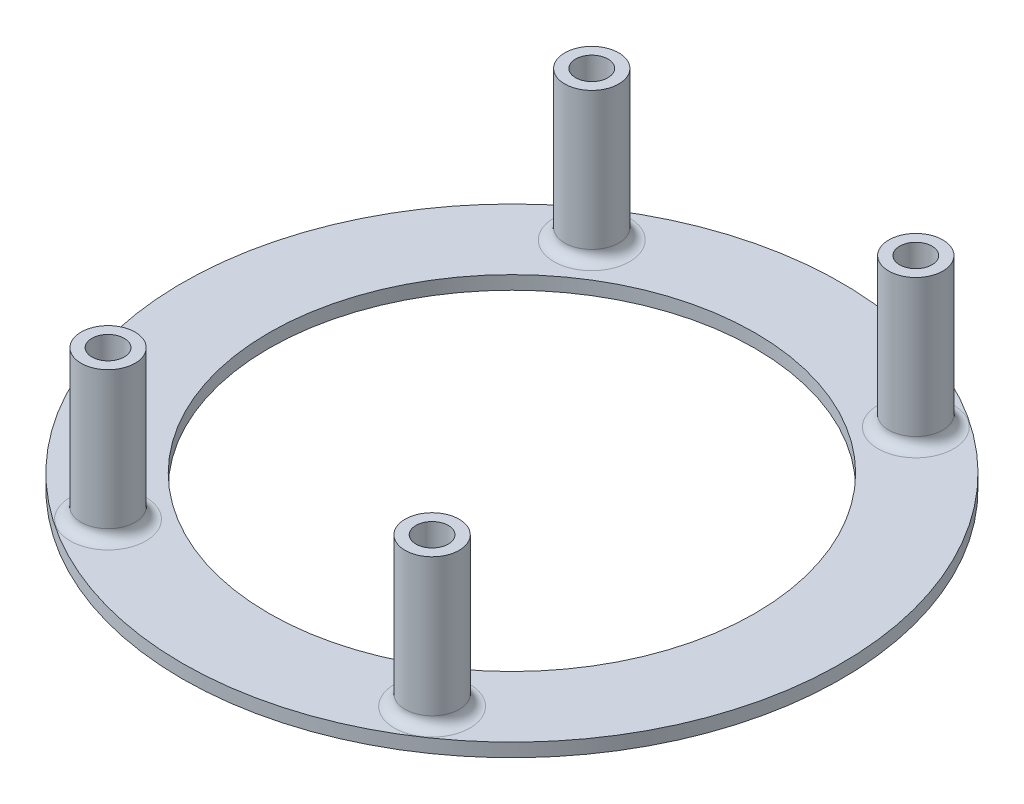
ISO-10303-21;
HEADER;
FILE_DESCRIPTION(('STEP AP214'),'2;1');
FILE_NAME('part.step','',(''),(''),'','','');
FILE_SCHEMA(('AUTOMOTIVE_DESIGN { 1 0 10303 214 1 1 1 1 }'));
ENDSEC;
DATA;
#1=APPLICATION_CONTEXT('core data for automotive mechanical design processes');
#2=APPLICATION_PROTOCOL_DEFINITION('international standard','automotive_design',2000,#1);
#3=PRODUCT_CONTEXT('',#1,'mechanical');
#4=PRODUCT('Part','Part','',(#3));
#5=PRODUCT_RELATED_PRODUCT_CATEGORY('part','',(#4));
#6=PRODUCT_DEFINITION_FORMATION('','',#4);
#7=PRODUCT_DEFINITION_CONTEXT('part definition',#1,'design');
#8=PRODUCT_DEFINITION('design','',#6,#7);
#9=PRODUCT_DEFINITION_SHAPE('','',#8);
#10=(LENGTH_UNIT() NAMED_UNIT(*) SI_UNIT(.MILLI.,.METRE.));
#11=(NAMED_UNIT(*) PLANE_ANGLE_UNIT() SI_UNIT($,.RADIAN.));
#12=(NAMED_UNIT(*) SI_UNIT($,.STERADIAN.) SOLID_ANGLE_UNIT());
#13=UNCERTAINTY_MEASURE_WITH_UNIT(LENGTH_MEASURE(1.E-05),#10,'distance_accuracy_value','');
#14=(GEOMETRIC_REPRESENTATION_CONTEXT(3) GLOBAL_UNCERTAINTY_ASSIGNED_CONTEXT((#13)) GLOBAL_UNIT_ASSIGNED_CONTEXT((#10,
#11,#12)) REPRESENTATION_CONTEXT('',''));
#15=CARTESIAN_POINT('',(0.,0.,0.));
#16=DIRECTION('',(0.,0.,1.));
#17=DIRECTION('',(1.,0.,0.));
#18=AXIS2_PLACEMENT_3D('',#15,#16,#17);
#19=CARTESIAN_POINT('',(-38.1,-5.40765999999999,-56.8700554685856));
#20=DIRECTION('',(0.,1.,0.));
#21=DIRECTION('',(0.,0.,1.));
#22=AXIS2_PLACEMENT_3D('',#19,#20,#21);
#23=PLANE('',#22);
#24=CARTESIAN_POINT('',(-38.1,-5.40765999999999,-56.8700554685856));
#25=DIRECTION('',(0.,1.,0.));
#26=DIRECTION('',(0.,0.,1.));
#27=AXIS2_PLACEMENT_3D('',#24,#25,#26);
#28=CIRCLE('',#27,6.35);
#29=CARTESIAN_POINT('',(-38.1,-5.40765999999999,-50.5200554685856));
#30=VERTEX_POINT('',#29);
#31=EDGE_CURVE('E73',#30,#30,#28,.T.);
#32=ORIENTED_EDGE('',*,*,#31,.T.);
#33=EDGE_LOOP('',(#32));
#34=FACE_BOUND('',#33,.T.);
#35=CARTESIAN_POINT('',(-38.1,-5.40765999999999,-56.8700554685856));
#36=DIRECTION('',(0.,1.,0.));
#37=DIRECTION('',(0.,0.,1.));
#38=AXIS2_PLACEMENT_3D('',#35,#36,#37);
#39=CIRCLE('',#38,3.81);
#40=CARTESIAN_POINT('',(-38.1,-5.40765999999999,-53.0600554685856));
#41=VERTEX_POINT('',#40);
#42=EDGE_CURVE('E76',#41,#41,#39,.T.);
#43=ORIENTED_EDGE('',*,*,#42,.F.);
#44=EDGE_LOOP('',(#43));
#45=FACE_BOUND('',#44,.T.);
#46=ADVANCED_FACE('F41',(#34,#45),#23,.T.);
#47=CARTESIAN_POINT('',(-38.1,-5.40765999999999,-56.8700554685856));
#48=DIRECTION('',(0.,-1.,0.));
#49=DIRECTION('',(0.,0.,-1.));
#50=AXIS2_PLACEMENT_3D('',#47,#48,#49);
#51=CYLINDRICAL_SURFACE('',#50,6.35);
#52=CARTESIAN_POINT('',(-38.1,-37.79266,-56.8700554685856));
#53=DIRECTION('',(0.,1.,0.));
#54=DIRECTION('',(0.,0.,1.));
#55=AXIS2_PLACEMENT_3D('',#52,#53,#54);
#56=CIRCLE('',#55,6.35);
#57=CARTESIAN_POINT('',(-38.1,-37.79266,-50.5200554685856));
#58=VERTEX_POINT('',#57);
#59=EDGE_CURVE('E48',#58,#58,#56,.T.);
#60=ORIENTED_EDGE('',*,*,#59,.T.);
#61=EDGE_LOOP('',(#60));
#62=FACE_BOUND('',#61,.T.);
#63=ORIENTED_EDGE('',*,*,#31,.F.);
#64=EDGE_LOOP('',(#63));
#65=FACE_BOUND('',#64,.T.);
#66=ADVANCED_FACE('F146',(#62,#65),#51,.T.);
#67=CARTESIAN_POINT('',(-38.1,-5.40765999999999,-56.8700554685856));
#68=DIRECTION('',(0.,-1.,0.));
#69=DIRECTION('',(0.,0.,-1.));
#70=AXIS2_PLACEMENT_3D('',#67,#68,#69);
#71=CYLINDRICAL_SURFACE('',#70,3.81);
#72=ORIENTED_EDGE('',*,*,#42,.T.);
#73=EDGE_LOOP('',(#72));
#74=FACE_BOUND('',#73,.T.);
#75=CARTESIAN_POINT('',(-38.1,-43.50766,-56.8700554685856));
#76=DIRECTION('',(0.,1.,0.));
#77=DIRECTION('',(0.,0.,1.));
#78=AXIS2_PLACEMENT_3D('',#75,#76,#77);
#79=CIRCLE('',#78,3.81);
#80=CARTESIAN_POINT('',(-38.1,-43.50766,-53.0600554685856));
#81=VERTEX_POINT('',#80);
#82=EDGE_CURVE('E113',#81,#81,#79,.T.);
#83=ORIENTED_EDGE('',*,*,#82,.F.);
#84=EDGE_LOOP('',(#83));
#85=FACE_BOUND('',#84,.T.);
#86=ADVANCED_FACE('F153',(#74,#85),#71,.F.);
#87=CARTESIAN_POINT('',(0.,-43.50766,0.));
#88=DIRECTION('',(0.,1.,0.));
#89=DIRECTION('',(0.,0.,1.));
#90=AXIS2_PLACEMENT_3D('',#87,#88,#89);
#91=CYLINDRICAL_SURFACE('',#90,77.4954);
#92=CARTESIAN_POINT('',(0.,-43.50766,0.));
#93=DIRECTION('',(0.,1.,0.));
#94=DIRECTION('',(0.,0.,1.));
#95=AXIS2_PLACEMENT_3D('',#92,#93,#94);
#96=CIRCLE('',#95,77.4954);
#97=CARTESIAN_POINT('',(0.,-43.50766,77.4954));
#98=VERTEX_POINT('',#97);
#99=EDGE_CURVE('E79',#98,#98,#96,.T.);
#100=ORIENTED_EDGE('',*,*,#99,.T.);
#101=EDGE_LOOP('',(#100));
#102=FACE_BOUND('',#101,.T.);
#103=CARTESIAN_POINT('',(0.,-40.33266,0.));
#104=DIRECTION('',(0.,1.,0.));
#105=DIRECTION('',(0.,0.,1.));
#106=AXIS2_PLACEMENT_3D('',#103,#104,#105);
#107=CIRCLE('',#106,77.4954);
#108=CARTESIAN_POINT('',(0.,-40.33266,77.4954));
#109=VERTEX_POINT('',#108);
#110=EDGE_CURVE('E80',#109,#109,#107,.T.);
#111=ORIENTED_EDGE('',*,*,#110,.F.);
#112=EDGE_LOOP('',(#111));
#113=FACE_BOUND('',#112,.T.);
#114=ADVANCED_FACE('F189',(#102,#113),#91,.T.);
#115=CARTESIAN_POINT('',(0.,-43.50766,0.));
#116=DIRECTION('',(0.,1.,0.));
#117=DIRECTION('',(0.,0.,1.));
#118=AXIS2_PLACEMENT_3D('',#115,#116,#117);
#119=PLANE('',#118);
#120=ORIENTED_EDGE('',*,*,#82,.T.);
#121=EDGE_LOOP('',(#120));
#122=FACE_BOUND('',#121,.T.);
#123=CARTESIAN_POINT('',(38.1,-43.50766,-56.8700554685856));
#124=DIRECTION('',(0.,1.,0.));
#125=DIRECTION('',(0.,0.,1.));
#126=AXIS2_PLACEMENT_3D('',#123,#124,#125);
#127=CIRCLE('',#126,3.81);
#128=CARTESIAN_POINT('',(38.1,-43.50766,-53.0600554685856));
#129=VERTEX_POINT('',#128);
#130=EDGE_CURVE('E116',#129,#129,#127,.T.);
#131=ORIENTED_EDGE('',*,*,#130,.T.);
#132=EDGE_LOOP('',(#131));
#133=FACE_BOUND('',#132,.T.);
#134=CARTESIAN_POINT('',(38.1,-43.50766,56.8700554685856));
#135=DIRECTION('',(0.,1.,0.));
#136=DIRECTION('',(0.,0.,1.));
#137=AXIS2_PLACEMENT_3D('',#134,#135,#136);
#138=CIRCLE('',#137,3.81);
#139=CARTESIAN_POINT('',(38.1,-43.50766,60.6800554685856));
#140=VERTEX_POINT('',#139);
#141=EDGE_CURVE('E112',#140,#140,#138,.T.);
#142=ORIENTED_EDGE('',*,*,#141,.T.);
#143=EDGE_LOOP('',(#142));
#144=FACE_BOUND('',#143,.T.);
#145=CARTESIAN_POINT('',(-38.1,-43.50766,56.8700554685856));
#146=DIRECTION('',(0.,1.,0.));
#147=DIRECTION('',(0.,0.,1.));
#148=AXIS2_PLACEMENT_3D('',#145,#146,#147);
#149=CIRCLE('',#148,3.81);
#150=CARTESIAN_POINT('',(-38.1,-43.50766,60.6800554685856));
#151=VERTEX_POINT('',#150);
#152=EDGE_CURVE('E109',#151,#151,#149,.T.);
#153=ORIENTED_EDGE('',*,*,#152,.T.);
#154=EDGE_LOOP('',(#153));
#155=FACE_BOUND('',#154,.T.);
#156=CARTESIAN_POINT('',(0.,-43.50766,0.));
#157=DIRECTION('',(0.,1.,0.));
#158=DIRECTION('',(0.,0.,1.));
#159=AXIS2_PLACEMENT_3D('',#156,#157,#158);
#160=CIRCLE('',#159,57.15);
#161=CARTESIAN_POINT('',(0.,-43.50766,57.15));
#162=VERTEX_POINT('',#161);
#163=EDGE_CURVE('E83',#162,#162,#160,.T.);
#164=ORIENTED_EDGE('',*,*,#163,.T.);
#165=EDGE_LOOP('',(#164));
#166=FACE_BOUND('',#165,.T.);
#167=ORIENTED_EDGE('',*,*,#99,.F.);
#168=EDGE_LOOP('',(#167));
#169=FACE_BOUND('',#168,.T.);
#170=ADVANCED_FACE('F122',(#122,#133,#144,#155,#166,#169),#119,.F.);
#171=CARTESIAN_POINT('',(0.,-40.33266,0.));
#172=DIRECTION('',(0.,1.,0.));
#173=DIRECTION('',(0.,0.,1.));
#174=AXIS2_PLACEMENT_3D('',#171,#172,#173);
#175=PLANE('',#174);
#176=CARTESIAN_POINT('',(38.1,-40.33266,56.8700554685856));
#177=DIRECTION('',(0.,1.,0.));
#178=DIRECTION('',(0.,0.,1.));
#179=AXIS2_PLACEMENT_3D('',#176,#177,#178);
#180=CIRCLE('',#179,8.89);
#181=CARTESIAN_POINT('',(38.1,-40.33266,65.7600554685856));
#182=VERTEX_POINT('',#181);
#183=EDGE_CURVE('E56',#182,#182,#180,.F.);
#184=ORIENTED_EDGE('',*,*,#183,.T.);
#185=EDGE_LOOP('',(#184));
#186=FACE_BOUND('',#185,.T.);
#187=CARTESIAN_POINT('',(-38.1,-40.33266,56.8700554685856));
#188=DIRECTION('',(0.,1.,0.));
#189=DIRECTION('',(0.,0.,1.));
#190=AXIS2_PLACEMENT_3D('',#187,#188,#189);
#191=CIRCLE('',#190,8.89);
#192=CARTESIAN_POINT('',(-38.1,-40.33266,65.7600554685856));
#193=VERTEX_POINT('',#192);
#194=EDGE_CURVE('E61',#193,#193,#191,.F.);
#195=ORIENTED_EDGE('',*,*,#194,.T.);
#196=EDGE_LOOP('',(#195));
#197=FACE_BOUND('',#196,.T.);
#198=CARTESIAN_POINT('',(-38.1,-40.33266,-56.8700554685856));
#199=DIRECTION('',(0.,1.,0.));
#200=DIRECTION('',(0.,0.,1.));
#201=AXIS2_PLACEMENT_3D('',#198,#199,#200);
#202=CIRCLE('',#201,8.89);
#203=CARTESIAN_POINT('',(-38.1,-40.33266,-47.9800554685856));
#204=VERTEX_POINT('',#203);
#205=EDGE_CURVE('E64',#204,#204,#202,.F.);
#206=ORIENTED_EDGE('',*,*,#205,.T.);
#207=EDGE_LOOP('',(#206));
#208=FACE_BOUND('',#207,.T.);
#209=CARTESIAN_POINT('',(38.1,-40.33266,-56.8700554685856));
#210=DIRECTION('',(0.,1.,0.));
#211=DIRECTION('',(0.,0.,1.));
#212=AXIS2_PLACEMENT_3D('',#209,#210,#211);
#213=CIRCLE('',#212,8.89);
#214=CARTESIAN_POINT('',(38.1,-40.33266,-47.9800554685856));
#215=VERTEX_POINT('',#214);
#216=EDGE_CURVE('E67',#215,#215,#213,.F.);
#217=ORIENTED_EDGE('',*,*,#216,.T.);
#218=EDGE_LOOP('',(#217));
#219=FACE_BOUND('',#218,.T.);
#220=CARTESIAN_POINT('',(0.,-40.33266,0.));
#221=DIRECTION('',(0.,1.,0.));
#222=DIRECTION('',(0.,0.,1.));
#223=AXIS2_PLACEMENT_3D('',#220,#221,#222);
#224=CIRCLE('',#223,57.15);
#225=CARTESIAN_POINT('',(0.,-40.33266,57.15));
#226=VERTEX_POINT('',#225);
#227=EDGE_CURVE('E86',#226,#226,#224,.T.);
#228=ORIENTED_EDGE('',*,*,#227,.F.);
#229=EDGE_LOOP('',(#228));
#230=FACE_BOUND('',#229,.T.);
#231=ORIENTED_EDGE('',*,*,#110,.T.);
#232=EDGE_LOOP('',(#231));
#233=FACE_BOUND('',#232,.T.);
#234=ADVANCED_FACE('F177',(#186,#197,#208,#219,#230,#233),#175,.T.);
#235=CARTESIAN_POINT('',(0.,-43.50766,0.));
#236=DIRECTION('',(0.,1.,0.));
#237=DIRECTION('',(0.,0.,1.));
#238=AXIS2_PLACEMENT_3D('',#235,#236,#237);
#239=CYLINDRICAL_SURFACE('',#238,57.15);
#240=ORIENTED_EDGE('',*,*,#163,.F.);
#241=EDGE_LOOP('',(#240));
#242=FACE_BOUND('',#241,.T.);
#243=ORIENTED_EDGE('',*,*,#227,.T.);
#244=EDGE_LOOP('',(#243));
#245=FACE_BOUND('',#244,.T.);
#246=ADVANCED_FACE('F180',(#242,#245),#239,.F.);
#247=CARTESIAN_POINT('',(38.1,-5.40765999999999,-56.8700554685856));
#248=DIRECTION('',(0.,1.,0.));
#249=DIRECTION('',(0.,0.,1.));
#250=AXIS2_PLACEMENT_3D('',#247,#248,#249);
#251=PLANE('',#250);
#252=CARTESIAN_POINT('',(38.1,-5.40765999999999,-56.8700554685856));
#253=DIRECTION('',(0.,1.,0.));
#254=DIRECTION('',(0.,0.,1.));
#255=AXIS2_PLACEMENT_3D('',#252,#253,#254);
#256=CIRCLE('',#255,6.35);
#257=CARTESIAN_POINT('',(38.1,-5.40765999999999,-50.5200554685856));
#258=VERTEX_POINT('',#257);
#259=EDGE_CURVE('E94',#258,#258,#256,.T.);
#260=ORIENTED_EDGE('',*,*,#259,.T.);
#261=EDGE_LOOP('',(#260));
#262=FACE_BOUND('',#261,.T.);
#263=CARTESIAN_POINT('',(38.1,-5.40765999999999,-56.8700554685856));
#264=DIRECTION('',(0.,1.,0.));
#265=DIRECTION('',(0.,0.,1.));
#266=AXIS2_PLACEMENT_3D('',#263,#264,#265);
#267=CIRCLE('',#266,3.81);
#268=CARTESIAN_POINT('',(38.1,-5.40765999999999,-53.0600554685856));
#269=VERTEX_POINT('',#268);
#270=EDGE_CURVE('E89',#269,#269,#267,.T.);
#271=ORIENTED_EDGE('',*,*,#270,.F.);
#272=EDGE_LOOP('',(#271));
#273=FACE_BOUND('',#272,.T.);
#274=ADVANCED_FACE('F201',(#262,#273),#251,.T.);
#275=CARTESIAN_POINT('',(38.1,-5.40765999999999,-56.8700554685856));
#276=DIRECTION('',(0.,-1.,0.));
#277=DIRECTION('',(0.,0.,-1.));
#278=AXIS2_PLACEMENT_3D('',#275,#276,#277);
#279=CYLINDRICAL_SURFACE('',#278,6.35);
#280=CARTESIAN_POINT('',(38.1,-37.79266,-56.8700554685856));
#281=DIRECTION('',(0.,1.,0.));
#282=DIRECTION('',(0.,0.,1.));
#283=AXIS2_PLACEMENT_3D('',#280,#281,#282);
#284=CIRCLE('',#283,6.35);
#285=CARTESIAN_POINT('',(38.1,-37.79266,-50.5200554685856));
#286=VERTEX_POINT('',#285);
#287=EDGE_CURVE('E10',#286,#286,#284,.T.);
#288=ORIENTED_EDGE('',*,*,#287,.T.);
#289=EDGE_LOOP('',(#288));
#290=FACE_BOUND('',#289,.T.);
#291=ORIENTED_EDGE('',*,*,#259,.F.);
#292=EDGE_LOOP('',(#291));
#293=FACE_BOUND('',#292,.T.);
#294=ADVANCED_FACE('F205',(#290,#293),#279,.T.);
#295=CARTESIAN_POINT('',(38.1,-5.40765999999999,-56.8700554685856));
#296=DIRECTION('',(0.,-1.,0.));
#297=DIRECTION('',(0.,0.,-1.));
#298=AXIS2_PLACEMENT_3D('',#295,#296,#297);
#299=CYLINDRICAL_SURFACE('',#298,3.81);
#300=ORIENTED_EDGE('',*,*,#270,.T.);
#301=EDGE_LOOP('',(#300));
#302=FACE_BOUND('',#301,.T.);
#303=ORIENTED_EDGE('',*,*,#130,.F.);
#304=EDGE_LOOP('',(#303));
#305=FACE_BOUND('',#304,.T.);
#306=ADVANCED_FACE('F203',(#302,#305),#299,.F.);
#307=CARTESIAN_POINT('',(38.1,-5.40765999999999,56.8700554685856));
#308=DIRECTION('',(0.,1.,0.));
#309=DIRECTION('',(0.,0.,1.));
#310=AXIS2_PLACEMENT_3D('',#307,#308,#309);
#311=PLANE('',#310);
#312=CARTESIAN_POINT('',(38.1,-5.40765999999999,56.8700554685856));
#313=DIRECTION('',(0.,1.,0.));
#314=DIRECTION('',(0.,0.,1.));
#315=AXIS2_PLACEMENT_3D('',#312,#313,#314);
#316=CIRCLE('',#315,6.35);
#317=CARTESIAN_POINT('',(38.1,-5.40765999999999,63.2200554685856));
#318=VERTEX_POINT('',#317);
#319=EDGE_CURVE('E100',#318,#318,#316,.T.);
#320=ORIENTED_EDGE('',*,*,#319,.T.);
#321=EDGE_LOOP('',(#320));
#322=FACE_BOUND('',#321,.T.);
#323=CARTESIAN_POINT('',(38.1,-5.40765999999999,56.8700554685856));
#324=DIRECTION('',(0.,1.,0.));
#325=DIRECTION('',(0.,0.,1.));
#326=AXIS2_PLACEMENT_3D('',#323,#324,#325);
#327=CIRCLE('',#326,3.81);
#328=CARTESIAN_POINT('',(38.1,-5.40765999999999,60.6800554685856));
#329=VERTEX_POINT('',#328);
#330=EDGE_CURVE('E97',#329,#329,#327,.T.);
#331=ORIENTED_EDGE('',*,*,#330,.F.);
#332=EDGE_LOOP('',(#331));
#333=FACE_BOUND('',#332,.T.);
#334=ADVANCED_FACE('F140',(#322,#333),#311,.T.);
#335=CARTESIAN_POINT('',(38.1,-5.40765999999999,56.8700554685856));
#336=DIRECTION('',(0.,-1.,0.));
#337=DIRECTION('',(0.,0.,-1.));
#338=AXIS2_PLACEMENT_3D('',#335,#336,#337);
#339=CYLINDRICAL_SURFACE('',#338,6.35);
#340=CARTESIAN_POINT('',(38.1,-37.79266,56.8700554685856));
#341=DIRECTION('',(0.,1.,0.));
#342=DIRECTION('',(0.,0.,1.));
#343=AXIS2_PLACEMENT_3D('',#340,#341,#342);
#344=CIRCLE('',#343,6.35);
#345=CARTESIAN_POINT('',(38.1,-37.79266,63.2200554685856));
#346=VERTEX_POINT('',#345);
#347=EDGE_CURVE('E70',#346,#346,#344,.T.);
#348=ORIENTED_EDGE('',*,*,#347,.T.);
#349=EDGE_LOOP('',(#348));
#350=FACE_BOUND('',#349,.T.);
#351=ORIENTED_EDGE('',*,*,#319,.F.);
#352=EDGE_LOOP('',(#351));
#353=FACE_BOUND('',#352,.T.);
#354=ADVANCED_FACE('F128',(#350,#353),#339,.T.);
#355=CARTESIAN_POINT('',(38.1,-5.40765999999999,56.8700554685856));
#356=DIRECTION('',(0.,-1.,0.));
#357=DIRECTION('',(0.,0.,-1.));
#358=AXIS2_PLACEMENT_3D('',#355,#356,#357);
#359=CYLINDRICAL_SURFACE('',#358,3.81);
#360=ORIENTED_EDGE('',*,*,#330,.T.);
#361=EDGE_LOOP('',(#360));
#362=FACE_BOUND('',#361,.T.);
#363=ORIENTED_EDGE('',*,*,#141,.F.);
#364=EDGE_LOOP('',(#363));
#365=FACE_BOUND('',#364,.T.);
#366=ADVANCED_FACE('F125',(#362,#365),#359,.F.);
#367=CARTESIAN_POINT('',(-38.1,-5.40765999999999,56.8700554685856));
#368=DIRECTION('',(0.,1.,0.));
#369=DIRECTION('',(0.,0.,1.));
#370=AXIS2_PLACEMENT_3D('',#367,#368,#369);
#371=PLANE('',#370);
#372=CARTESIAN_POINT('',(-38.1,-5.40765999999999,56.8700554685856));
#373=DIRECTION('',(0.,1.,0.));
#374=DIRECTION('',(0.,0.,1.));
#375=AXIS2_PLACEMENT_3D('',#372,#373,#374);
#376=CIRCLE('',#375,6.35);
#377=CARTESIAN_POINT('',(-38.1,-5.40765999999999,63.2200554685856));
#378=VERTEX_POINT('',#377);
#379=EDGE_CURVE('E106',#378,#378,#376,.T.);
#380=ORIENTED_EDGE('',*,*,#379,.T.);
#381=EDGE_LOOP('',(#380));
#382=FACE_BOUND('',#381,.T.);
#383=CARTESIAN_POINT('',(-38.1,-5.40765999999999,56.8700554685856));
#384=DIRECTION('',(0.,1.,0.));
#385=DIRECTION('',(0.,0.,1.));
#386=AXIS2_PLACEMENT_3D('',#383,#384,#385);
#387=CIRCLE('',#386,3.81);
#388=CARTESIAN_POINT('',(-38.1,-5.40765999999999,60.6800554685856));
#389=VERTEX_POINT('',#388);
#390=EDGE_CURVE('E103',#389,#389,#387,.T.);
#391=ORIENTED_EDGE('',*,*,#390,.F.);
#392=EDGE_LOOP('',(#391));
#393=FACE_BOUND('',#392,.T.);
#394=ADVANCED_FACE('F127',(#382,#393),#371,.T.);
#395=CARTESIAN_POINT('',(-38.1,-5.40765999999999,56.8700554685856));
#396=DIRECTION('',(0.,-1.,0.));
#397=DIRECTION('',(0.,0.,-1.));
#398=AXIS2_PLACEMENT_3D('',#395,#396,#397);
#399=CYLINDRICAL_SURFACE('',#398,6.35);
#400=CARTESIAN_POINT('',(-38.1,-37.79266,56.8700554685856));
#401=DIRECTION('',(0.,1.,0.));
#402=DIRECTION('',(0.,0.,1.));
#403=AXIS2_PLACEMENT_3D('',#400,#401,#402);
#404=CIRCLE('',#403,6.35);
#405=CARTESIAN_POINT('',(-38.1,-37.79266,63.2200554685856));
#406=VERTEX_POINT('',#405);
#407=EDGE_CURVE('E52',#406,#406,#404,.T.);
#408=ORIENTED_EDGE('',*,*,#407,.T.);
#409=EDGE_LOOP('',(#408));
#410=FACE_BOUND('',#409,.T.);
#411=ORIENTED_EDGE('',*,*,#379,.F.);
#412=EDGE_LOOP('',(#411));
#413=FACE_BOUND('',#412,.T.);
#414=ADVANCED_FACE('F136',(#410,#413),#399,.T.);
#415=CARTESIAN_POINT('',(-38.1,-5.40765999999999,56.8700554685856));
#416=DIRECTION('',(0.,-1.,0.));
#417=DIRECTION('',(0.,0.,-1.));
#418=AXIS2_PLACEMENT_3D('',#415,#416,#417);
#419=CYLINDRICAL_SURFACE('',#418,3.81);
#420=ORIENTED_EDGE('',*,*,#390,.T.);
#421=EDGE_LOOP('',(#420));
#422=FACE_BOUND('',#421,.T.);
#423=ORIENTED_EDGE('',*,*,#152,.F.);
#424=EDGE_LOOP('',(#423));
#425=FACE_BOUND('',#424,.T.);
#426=ADVANCED_FACE('F163',(#422,#425),#419,.F.);
#427=CARTESIAN_POINT('',(38.1,-37.79266,56.8700554685856));
#428=DIRECTION('',(0.,1.,0.));
#429=DIRECTION('',(0.,0.,1.));
#430=AXIS2_PLACEMENT_3D('',#427,#428,#429);
#431=TOROIDAL_SURFACE('',#430,8.89,2.54);
#432=ORIENTED_EDGE('',*,*,#183,.F.);
#433=EDGE_LOOP('',(#432));
#434=FACE_BOUND('',#433,.T.);
#435=ORIENTED_EDGE('',*,*,#347,.F.);
#436=EDGE_LOOP('',(#435));
#437=FACE_BOUND('',#436,.T.);
#438=ADVANCED_FACE('F159',(#434,#437),#431,.F.);
#439=CARTESIAN_POINT('',(-38.1,-37.79266,56.8700554685856));
#440=DIRECTION('',(0.,1.,0.));
#441=DIRECTION('',(0.,0.,1.));
#442=AXIS2_PLACEMENT_3D('',#439,#440,#441);
#443=TOROIDAL_SURFACE('',#442,8.89,2.54);
#444=ORIENTED_EDGE('',*,*,#194,.F.);
#445=EDGE_LOOP('',(#444));
#446=FACE_BOUND('',#445,.T.);
#447=ORIENTED_EDGE('',*,*,#407,.F.);
#448=EDGE_LOOP('',(#447));
#449=FACE_BOUND('',#448,.T.);
#450=ADVANCED_FACE('F162',(#446,#449),#443,.F.);
#451=CARTESIAN_POINT('',(-38.1,-37.79266,-56.8700554685856));
#452=DIRECTION('',(0.,1.,0.));
#453=DIRECTION('',(0.,0.,1.));
#454=AXIS2_PLACEMENT_3D('',#451,#452,#453);
#455=TOROIDAL_SURFACE('',#454,8.89,2.54);
#456=ORIENTED_EDGE('',*,*,#205,.F.);
#457=EDGE_LOOP('',(#456));
#458=FACE_BOUND('',#457,.T.);
#459=ORIENTED_EDGE('',*,*,#59,.F.);
#460=EDGE_LOOP('',(#459));
#461=FACE_BOUND('',#460,.T.);
#462=ADVANCED_FACE('F166',(#458,#461),#455,.F.);
#463=CARTESIAN_POINT('',(38.1,-37.79266,-56.8700554685856));
#464=DIRECTION('',(0.,1.,0.));
#465=DIRECTION('',(0.,0.,1.));
#466=AXIS2_PLACEMENT_3D('',#463,#464,#465);
#467=TOROIDAL_SURFACE('',#466,8.89,2.54);
#468=ORIENTED_EDGE('',*,*,#216,.F.);
#469=EDGE_LOOP('',(#468));
#470=FACE_BOUND('',#469,.T.);
#471=ORIENTED_EDGE('',*,*,#287,.F.);
#472=EDGE_LOOP('',(#471));
#473=FACE_BOUND('',#472,.T.);
#474=ADVANCED_FACE('F43',(#470,#473),#467,.F.);
#475=CLOSED_SHELL('',(#46,#66,#86,#114,#170,#234,#246,#274,#294,#306,#334,#354,#366,#394,#414,
#426,#438,#450,#462,#474));
#476=MANIFOLD_SOLID_BREP('B2',#475);
#477=ADVANCED_BREP_SHAPE_REPRESENTATION('',(#18,#476),#14);
#478=SHAPE_DEFINITION_REPRESENTATION(#9,#477);
ENDSEC;
END-ISO-10303-21;
